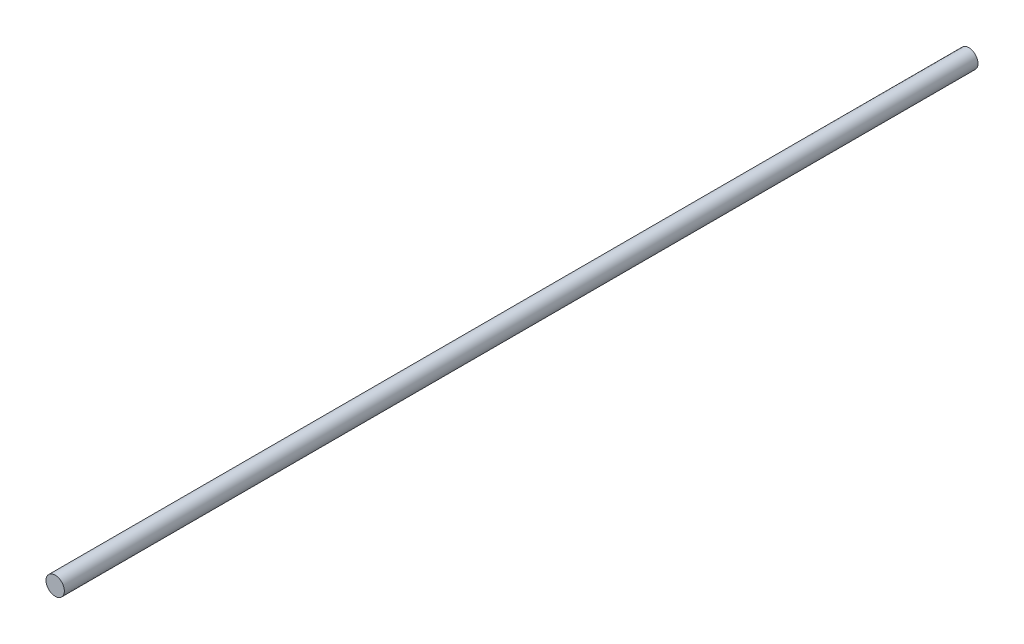
ISO-10303-21;
HEADER;
FILE_DESCRIPTION(('STEP AP214'),'2;1');
FILE_NAME('part.step','',(''),(''),'','','');
FILE_SCHEMA(('AUTOMOTIVE_DESIGN { 1 0 10303 214 1 1 1 1 }'));
ENDSEC;
DATA;
#1=APPLICATION_CONTEXT('core data for automotive mechanical design processes');
#2=APPLICATION_PROTOCOL_DEFINITION('international standard','automotive_design',2000,#1);
#3=PRODUCT_CONTEXT('',#1,'mechanical');
#4=PRODUCT('Part','Part','',(#3));
#5=PRODUCT_RELATED_PRODUCT_CATEGORY('part','',(#4));
#6=PRODUCT_DEFINITION_FORMATION('','',#4);
#7=PRODUCT_DEFINITION_CONTEXT('part definition',#1,'design');
#8=PRODUCT_DEFINITION('design','',#6,#7);
#9=PRODUCT_DEFINITION_SHAPE('','',#8);
#10=(LENGTH_UNIT() NAMED_UNIT(*) SI_UNIT(.MILLI.,.METRE.));
#11=(NAMED_UNIT(*) PLANE_ANGLE_UNIT() SI_UNIT($,.RADIAN.));
#12=(NAMED_UNIT(*) SI_UNIT($,.STERADIAN.) SOLID_ANGLE_UNIT());
#13=UNCERTAINTY_MEASURE_WITH_UNIT(LENGTH_MEASURE(1.E-05),#10,'distance_accuracy_value','');
#14=(GEOMETRIC_REPRESENTATION_CONTEXT(3) GLOBAL_UNCERTAINTY_ASSIGNED_CONTEXT((#13)) GLOBAL_UNIT_ASSIGNED_CONTEXT((#10,
#11,#12)) REPRESENTATION_CONTEXT('',''));
#15=CARTESIAN_POINT('',(0.,0.,0.));
#16=DIRECTION('',(0.,0.,1.));
#17=DIRECTION('',(1.,0.,0.));
#18=AXIS2_PLACEMENT_3D('',#15,#16,#17);
#19=CARTESIAN_POINT('',(0.,0.,197.5));
#20=DIRECTION('',(0.,0.,-1.));
#21=DIRECTION('',(-1.,0.,0.));
#22=AXIS2_PLACEMENT_3D('',#19,#20,#21);
#23=CYLINDRICAL_SURFACE('',#22,3.97);
#24=CARTESIAN_POINT('',(0.,0.,197.5));
#25=DIRECTION('',(0.,0.,1.));
#26=DIRECTION('',(1.,0.,0.));
#27=AXIS2_PLACEMENT_3D('',#24,#25,#26);
#28=CIRCLE('',#27,3.97);
#29=CARTESIAN_POINT('',(3.97,0.,197.5));
#30=VERTEX_POINT('',#29);
#31=EDGE_CURVE('E10',#30,#30,#28,.T.);
#32=ORIENTED_EDGE('',*,*,#31,.F.);
#33=EDGE_LOOP('',(#32));
#34=FACE_BOUND('',#33,.T.);
#35=CARTESIAN_POINT('',(0.,0.,-197.5));
#36=DIRECTION('',(0.,0.,1.));
#37=DIRECTION('',(1.,0.,0.));
#38=AXIS2_PLACEMENT_3D('',#35,#36,#37);
#39=CIRCLE('',#38,3.97);
#40=CARTESIAN_POINT('',(3.97,0.,-197.5));
#41=VERTEX_POINT('',#40);
#42=EDGE_CURVE('E39',#41,#41,#39,.T.);
#43=ORIENTED_EDGE('',*,*,#42,.T.);
#44=EDGE_LOOP('',(#43));
#45=FACE_BOUND('',#44,.T.);
#46=ADVANCED_FACE('F36',(#34,#45),#23,.T.);
#47=CARTESIAN_POINT('',(0.,0.,197.5));
#48=DIRECTION('',(0.,0.,1.));
#49=DIRECTION('',(1.,0.,0.));
#50=AXIS2_PLACEMENT_3D('',#47,#48,#49);
#51=PLANE('',#50);
#52=ORIENTED_EDGE('',*,*,#31,.T.);
#53=EDGE_LOOP('',(#52));
#54=FACE_BOUND('',#53,.T.);
#55=ADVANCED_FACE('F51',(#54),#51,.T.);
#56=CARTESIAN_POINT('',(0.,0.,-197.5));
#57=DIRECTION('',(0.,0.,1.));
#58=DIRECTION('',(1.,0.,0.));
#59=AXIS2_PLACEMENT_3D('',#56,#57,#58);
#60=PLANE('',#59);
#61=ORIENTED_EDGE('',*,*,#42,.F.);
#62=EDGE_LOOP('',(#61));
#63=FACE_BOUND('',#62,.T.);
#64=ADVANCED_FACE('F49',(#63),#60,.F.);
#65=CLOSED_SHELL('',(#46,#55,#64));
#66=MANIFOLD_SOLID_BREP('B2',#65);
#67=ADVANCED_BREP_SHAPE_REPRESENTATION('',(#18,#66),#14);
#68=SHAPE_DEFINITION_REPRESENTATION(#9,#67);
ENDSEC;
END-ISO-10303-21;
